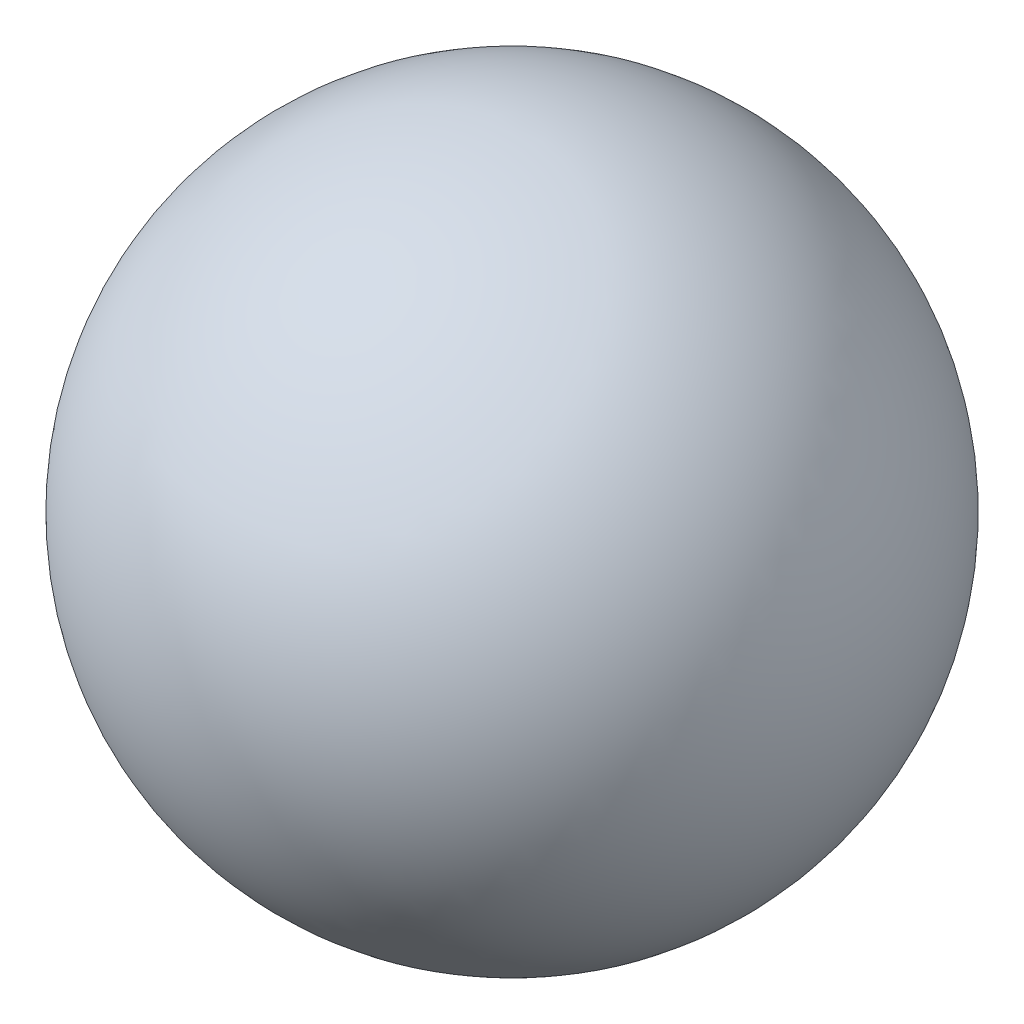
ISO-10303-21;
HEADER;
FILE_DESCRIPTION(('STEP AP214'),'2;1');
FILE_NAME('part.step','',(''),(''),'','','');
FILE_SCHEMA(('AUTOMOTIVE_DESIGN { 1 0 10303 214 1 1 1 1 }'));
ENDSEC;
DATA;
#1=APPLICATION_CONTEXT('core data for automotive mechanical design processes');
#2=APPLICATION_PROTOCOL_DEFINITION('international standard','automotive_design',2000,#1);
#3=PRODUCT_CONTEXT('',#1,'mechanical');
#4=PRODUCT('Part','Part','',(#3));
#5=PRODUCT_RELATED_PRODUCT_CATEGORY('part','',(#4));
#6=PRODUCT_DEFINITION_FORMATION('','',#4);
#7=PRODUCT_DEFINITION_CONTEXT('part definition',#1,'design');
#8=PRODUCT_DEFINITION('design','',#6,#7);
#9=PRODUCT_DEFINITION_SHAPE('','',#8);
#10=(LENGTH_UNIT() NAMED_UNIT(*) SI_UNIT(.MILLI.,.METRE.));
#11=(NAMED_UNIT(*) PLANE_ANGLE_UNIT() SI_UNIT($,.RADIAN.));
#12=(NAMED_UNIT(*) SI_UNIT($,.STERADIAN.) SOLID_ANGLE_UNIT());
#13=UNCERTAINTY_MEASURE_WITH_UNIT(LENGTH_MEASURE(1.E-05),#10,'distance_accuracy_value','');
#14=(GEOMETRIC_REPRESENTATION_CONTEXT(3) GLOBAL_UNCERTAINTY_ASSIGNED_CONTEXT((#13)) GLOBAL_UNIT_ASSIGNED_CONTEXT((#10,
#11,#12)) REPRESENTATION_CONTEXT('',''));
#15=CARTESIAN_POINT('',(0.,0.,0.));
#16=DIRECTION('',(0.,0.,1.));
#17=DIRECTION('',(1.,0.,0.));
#18=AXIS2_PLACEMENT_3D('',#15,#16,#17);
#19=CARTESIAN_POINT('',(0.,0.,0.));
#20=DIRECTION('',(0.,1.,0.));
#21=DIRECTION('',(1.,0.,0.));
#22=AXIS2_PLACEMENT_3D('',#19,#20,#21);
#23=SPHERICAL_SURFACE('',#22,32.5);
#24=CARTESIAN_POINT('',(0.,32.5,0.));
#25=VERTEX_POINT('',#24);
#26=VERTEX_LOOP('',#25);
#27=FACE_BOUND('',#26,.T.);
#28=ADVANCED_FACE('F33',(#27),#23,.T.);
#29=CLOSED_SHELL('',(#28));
#30=MANIFOLD_SOLID_BREP('B2',#29);
#31=ADVANCED_BREP_SHAPE_REPRESENTATION('',(#18,#30),#14);
#32=SHAPE_DEFINITION_REPRESENTATION(#9,#31);
ENDSEC;
END-ISO-10303-21;
